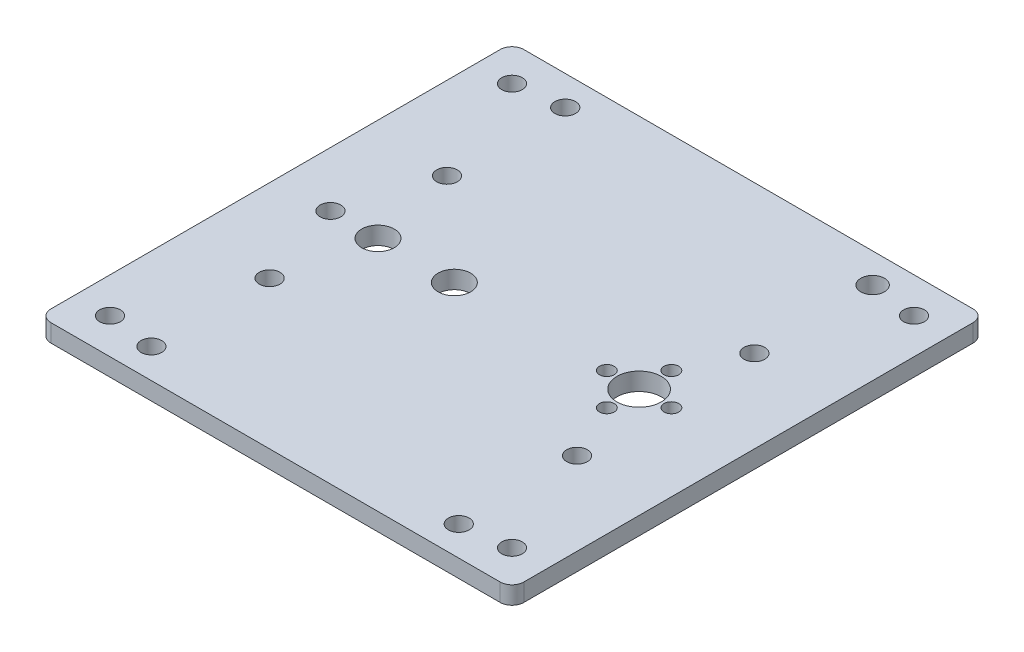
ISO-10303-21;
HEADER;
FILE_DESCRIPTION(('STEP AP214'),'2;1');
FILE_NAME('part.step','',(''),(''),'','','');
FILE_SCHEMA(('AUTOMOTIVE_DESIGN { 1 0 10303 214 1 1 1 1 }'));
ENDSEC;
DATA;
#1=APPLICATION_CONTEXT('core data for automotive mechanical design processes');
#2=APPLICATION_PROTOCOL_DEFINITION('international standard','automotive_design',2000,#1);
#3=PRODUCT_CONTEXT('',#1,'mechanical');
#4=PRODUCT('Part','Part','',(#3));
#5=PRODUCT_RELATED_PRODUCT_CATEGORY('part','',(#4));
#6=PRODUCT_DEFINITION_FORMATION('','',#4);
#7=PRODUCT_DEFINITION_CONTEXT('part definition',#1,'design');
#8=PRODUCT_DEFINITION('design','',#6,#7);
#9=PRODUCT_DEFINITION_SHAPE('','',#8);
#10=(LENGTH_UNIT() NAMED_UNIT(*) SI_UNIT(.MILLI.,.METRE.));
#11=(NAMED_UNIT(*) PLANE_ANGLE_UNIT() SI_UNIT($,.RADIAN.));
#12=(NAMED_UNIT(*) SI_UNIT($,.STERADIAN.) SOLID_ANGLE_UNIT());
#13=UNCERTAINTY_MEASURE_WITH_UNIT(LENGTH_MEASURE(1.E-05),#10,'distance_accuracy_value','');
#14=(GEOMETRIC_REPRESENTATION_CONTEXT(3) GLOBAL_UNCERTAINTY_ASSIGNED_CONTEXT((#13)) GLOBAL_UNIT_ASSIGNED_CONTEXT((#10,
#11,#12)) REPRESENTATION_CONTEXT('',''));
#15=CARTESIAN_POINT('',(0.,0.,0.));
#16=DIRECTION('',(0.,0.,1.));
#17=DIRECTION('',(1.,0.,0.));
#18=AXIS2_PLACEMENT_3D('',#15,#16,#17);
#19=CARTESIAN_POINT('',(0.,3.,0.));
#20=DIRECTION('',(1.,0.,0.));
#21=DIRECTION('',(0.,0.,-1.));
#22=AXIS2_PLACEMENT_3D('',#19,#20,#21);
#23=PLANE('',#22);
#24=DIRECTION('',(0.,0.,1.));
#25=VECTOR('',#24,1.);
#26=CARTESIAN_POINT('',(0.,3.,0.));
#27=LINE('',#26,#25);
#28=CARTESIAN_POINT('',(0.,3.,-78.));
#29=VERTEX_POINT('',#28);
#30=CARTESIAN_POINT('',(0.,3.,-2.));
#31=VERTEX_POINT('',#30);
#32=EDGE_CURVE('E119',#29,#31,#27,.T.);
#33=ORIENTED_EDGE('',*,*,#32,.F.);
#34=DIRECTION('',(0.,-1.,0.));
#35=VECTOR('',#34,1.);
#36=CARTESIAN_POINT('',(0.,3.,-78.));
#37=LINE('',#36,#35);
#38=CARTESIAN_POINT('',(0.,0.,-78.));
#39=VERTEX_POINT('',#38);
#40=EDGE_CURVE('E104',#29,#39,#37,.T.);
#41=ORIENTED_EDGE('',*,*,#40,.T.);
#42=DIRECTION('',(0.,0.,1.));
#43=VECTOR('',#42,1.);
#44=CARTESIAN_POINT('',(0.,0.,0.));
#45=LINE('',#44,#43);
#46=CARTESIAN_POINT('',(0.,0.,-2.));
#47=VERTEX_POINT('',#46);
#48=EDGE_CURVE('E116',#39,#47,#45,.T.);
#49=ORIENTED_EDGE('',*,*,#48,.T.);
#50=DIRECTION('',(0.,-1.,0.));
#51=VECTOR('',#50,1.);
#52=CARTESIAN_POINT('',(0.,3.,-2.));
#53=LINE('',#52,#51);
#54=EDGE_CURVE('E121',#47,#31,#53,.F.);
#55=ORIENTED_EDGE('',*,*,#54,.T.);
#56=EDGE_LOOP('',(#33,#41,#49,#55));
#57=FACE_BOUND('',#56,.T.);
#58=ADVANCED_FACE('F33',(#57),#23,.F.);
#59=CARTESIAN_POINT('',(0.,3.,0.));
#60=DIRECTION('',(0.,0.,-1.));
#61=DIRECTION('',(-1.,0.,0.));
#62=AXIS2_PLACEMENT_3D('',#59,#60,#61);
#63=PLANE('',#62);
#64=DIRECTION('',(1.,0.,0.));
#65=VECTOR('',#64,1.);
#66=CARTESIAN_POINT('',(0.,3.,0.));
#67=LINE('',#66,#65);
#68=CARTESIAN_POINT('',(2.,3.,0.));
#69=VERTEX_POINT('',#68);
#70=CARTESIAN_POINT('',(78.,3.,0.));
#71=VERTEX_POINT('',#70);
#72=EDGE_CURVE('E163',#69,#71,#67,.T.);
#73=ORIENTED_EDGE('',*,*,#72,.F.);
#74=DIRECTION('',(0.,-1.,0.));
#75=VECTOR('',#74,1.);
#76=CARTESIAN_POINT('',(2.,3.,0.));
#77=LINE('',#76,#75);
#78=CARTESIAN_POINT('',(2.,0.,0.));
#79=VERTEX_POINT('',#78);
#80=EDGE_CURVE('E11',#69,#79,#77,.T.);
#81=ORIENTED_EDGE('',*,*,#80,.T.);
#82=DIRECTION('',(1.,0.,0.));
#83=VECTOR('',#82,1.);
#84=CARTESIAN_POINT('',(0.,0.,0.));
#85=LINE('',#84,#83);
#86=CARTESIAN_POINT('',(78.,0.,0.));
#87=VERTEX_POINT('',#86);
#88=EDGE_CURVE('E126',#79,#87,#85,.T.);
#89=ORIENTED_EDGE('',*,*,#88,.T.);
#90=DIRECTION('',(0.,-1.,0.));
#91=VECTOR('',#90,1.);
#92=CARTESIAN_POINT('',(78.,3.,0.));
#93=LINE('',#92,#91);
#94=EDGE_CURVE('E41',#87,#71,#93,.F.);
#95=ORIENTED_EDGE('',*,*,#94,.T.);
#96=EDGE_LOOP('',(#73,#81,#89,#95));
#97=FACE_BOUND('',#96,.T.);
#98=ADVANCED_FACE('F162',(#97),#63,.F.);
#99=CARTESIAN_POINT('',(80.,3.,0.));
#100=DIRECTION('',(-1.,0.,0.));
#101=DIRECTION('',(0.,0.,1.));
#102=AXIS2_PLACEMENT_3D('',#99,#100,#101);
#103=PLANE('',#102);
#104=DIRECTION('',(0.,0.,-1.));
#105=VECTOR('',#104,1.);
#106=CARTESIAN_POINT('',(80.,0.,0.));
#107=LINE('',#106,#105);
#108=CARTESIAN_POINT('',(80.,0.,-2.));
#109=VERTEX_POINT('',#108);
#110=CARTESIAN_POINT('',(80.,0.,-78.));
#111=VERTEX_POINT('',#110);
#112=EDGE_CURVE('E130',#109,#111,#107,.T.);
#113=ORIENTED_EDGE('',*,*,#112,.T.);
#114=DIRECTION('',(0.,-1.,0.));
#115=VECTOR('',#114,1.);
#116=CARTESIAN_POINT('',(80.,3.,-78.));
#117=LINE('',#116,#115);
#118=CARTESIAN_POINT('',(80.,3.,-78.));
#119=VERTEX_POINT('',#118);
#120=EDGE_CURVE('E48',#111,#119,#117,.F.);
#121=ORIENTED_EDGE('',*,*,#120,.T.);
#122=DIRECTION('',(0.,0.,-1.));
#123=VECTOR('',#122,1.);
#124=CARTESIAN_POINT('',(80.,3.,0.));
#125=LINE('',#124,#123);
#126=CARTESIAN_POINT('',(80.,3.,-2.));
#127=VERTEX_POINT('',#126);
#128=EDGE_CURVE('E169',#127,#119,#125,.T.);
#129=ORIENTED_EDGE('',*,*,#128,.F.);
#130=DIRECTION('',(0.,-1.,0.));
#131=VECTOR('',#130,1.);
#132=CARTESIAN_POINT('',(80.,3.,-2.));
#133=LINE('',#132,#131);
#134=EDGE_CURVE('E156',#127,#109,#133,.T.);
#135=ORIENTED_EDGE('',*,*,#134,.T.);
#136=EDGE_LOOP('',(#113,#121,#129,#135));
#137=FACE_BOUND('',#136,.T.);
#138=ADVANCED_FACE('F173',(#137),#103,.F.);
#139=CARTESIAN_POINT('',(0.,3.,-80.));
#140=DIRECTION('',(0.,0.,1.));
#141=DIRECTION('',(1.,0.,0.));
#142=AXIS2_PLACEMENT_3D('',#139,#140,#141);
#143=PLANE('',#142);
#144=DIRECTION('',(-1.,0.,0.));
#145=VECTOR('',#144,1.);
#146=CARTESIAN_POINT('',(0.,0.,-80.));
#147=LINE('',#146,#145);
#148=CARTESIAN_POINT('',(78.,0.,-80.));
#149=VERTEX_POINT('',#148);
#150=CARTESIAN_POINT('',(2.,0.,-80.));
#151=VERTEX_POINT('',#150);
#152=EDGE_CURVE('E140',#149,#151,#147,.T.);
#153=ORIENTED_EDGE('',*,*,#152,.T.);
#154=DIRECTION('',(0.,-1.,0.));
#155=VECTOR('',#154,1.);
#156=CARTESIAN_POINT('',(2.,3.,-80.));
#157=LINE('',#156,#155);
#158=CARTESIAN_POINT('',(2.,3.,-80.));
#159=VERTEX_POINT('',#158);
#160=EDGE_CURVE('E105',#151,#159,#157,.F.);
#161=ORIENTED_EDGE('',*,*,#160,.T.);
#162=DIRECTION('',(-1.,0.,0.));
#163=VECTOR('',#162,1.);
#164=CARTESIAN_POINT('',(0.,3.,-80.));
#165=LINE('',#164,#163);
#166=CARTESIAN_POINT('',(78.,3.,-80.));
#167=VERTEX_POINT('',#166);
#168=EDGE_CURVE('E136',#167,#159,#165,.T.);
#169=ORIENTED_EDGE('',*,*,#168,.F.);
#170=DIRECTION('',(0.,-1.,0.));
#171=VECTOR('',#170,1.);
#172=CARTESIAN_POINT('',(78.,3.,-80.));
#173=LINE('',#172,#171);
#174=EDGE_CURVE('E110',#167,#149,#173,.T.);
#175=ORIENTED_EDGE('',*,*,#174,.T.);
#176=EDGE_LOOP('',(#153,#161,#169,#175));
#177=FACE_BOUND('',#176,.T.);
#178=ADVANCED_FACE('F180',(#177),#143,.F.);
#179=CARTESIAN_POINT('',(0.,3.,0.));
#180=DIRECTION('',(0.,-1.,0.));
#181=DIRECTION('',(0.,0.,-1.));
#182=AXIS2_PLACEMENT_3D('',#179,#180,#181);
#183=PLANE('',#182);
#184=CARTESIAN_POINT('',(66.,3.,-55.));
#185=DIRECTION('',(0.,1.,0.));
#186=DIRECTION('',(0.,0.,1.));
#187=AXIS2_PLACEMENT_3D('',#184,#185,#186);
#188=CIRCLE('',#187,1.75);
#189=CARTESIAN_POINT('',(66.,3.,-53.25));
#190=VERTEX_POINT('',#189);
#191=EDGE_CURVE('E294',#190,#190,#188,.T.);
#192=ORIENTED_EDGE('',*,*,#191,.F.);
#193=EDGE_LOOP('',(#192));
#194=FACE_BOUND('',#193,.T.);
#195=CARTESIAN_POINT('',(66.,3.,-75.));
#196=DIRECTION('',(0.,1.,0.));
#197=DIRECTION('',(0.,0.,1.));
#198=AXIS2_PLACEMENT_3D('',#195,#196,#197);
#199=CIRCLE('',#198,2.);
#200=CARTESIAN_POINT('',(66.,3.,-73.));
#201=VERTEX_POINT('',#200);
#202=EDGE_CURVE('E288',#201,#201,#199,.T.);
#203=ORIENTED_EDGE('',*,*,#202,.F.);
#204=EDGE_LOOP('',(#203));
#205=FACE_BOUND('',#204,.T.);
#206=CARTESIAN_POINT('',(14.,3.,-55.));
#207=DIRECTION('',(0.,1.,0.));
#208=DIRECTION('',(0.,0.,1.));
#209=AXIS2_PLACEMENT_3D('',#206,#207,#208);
#210=CIRCLE('',#209,1.75);
#211=CARTESIAN_POINT('',(14.,3.,-53.25));
#212=VERTEX_POINT('',#211);
#213=EDGE_CURVE('E282',#212,#212,#210,.T.);
#214=ORIENTED_EDGE('',*,*,#213,.F.);
#215=EDGE_LOOP('',(#214));
#216=FACE_BOUND('',#215,.T.);
#217=CARTESIAN_POINT('',(14.,3.,-75.));
#218=DIRECTION('',(0.,1.,0.));
#219=DIRECTION('',(0.,0.,1.));
#220=AXIS2_PLACEMENT_3D('',#217,#218,#219);
#221=CIRCLE('',#220,1.75);
#222=CARTESIAN_POINT('',(14.,3.,-73.25));
#223=VERTEX_POINT('',#222);
#224=EDGE_CURVE('E276',#223,#223,#221,.T.);
#225=ORIENTED_EDGE('',*,*,#224,.F.);
#226=EDGE_LOOP('',(#225));
#227=FACE_BOUND('',#226,.T.);
#228=CARTESIAN_POINT('',(14.,3.,-5.));
#229=DIRECTION('',(0.,1.,0.));
#230=DIRECTION('',(0.,0.,1.));
#231=AXIS2_PLACEMENT_3D('',#228,#229,#230);
#232=CIRCLE('',#231,1.75);
#233=CARTESIAN_POINT('',(14.,3.,-3.25000000000001));
#234=VERTEX_POINT('',#233);
#235=EDGE_CURVE('E270',#234,#234,#232,.T.);
#236=ORIENTED_EDGE('',*,*,#235,.F.);
#237=EDGE_LOOP('',(#236));
#238=FACE_BOUND('',#237,.T.);
#239=CARTESIAN_POINT('',(14.,3.,-25.));
#240=DIRECTION('',(0.,1.,0.));
#241=DIRECTION('',(0.,0.,1.));
#242=AXIS2_PLACEMENT_3D('',#239,#240,#241);
#243=CIRCLE('',#242,1.75);
#244=CARTESIAN_POINT('',(14.,3.,-23.25));
#245=VERTEX_POINT('',#244);
#246=EDGE_CURVE('E264',#245,#245,#243,.T.);
#247=ORIENTED_EDGE('',*,*,#246,.F.);
#248=EDGE_LOOP('',(#247));
#249=FACE_BOUND('',#248,.T.);
#250=CARTESIAN_POINT('',(66.,3.,-25.));
#251=DIRECTION('',(0.,1.,0.));
#252=DIRECTION('',(0.,0.,1.));
#253=AXIS2_PLACEMENT_3D('',#250,#251,#252);
#254=CIRCLE('',#253,1.75);
#255=CARTESIAN_POINT('',(66.,3.,-23.25));
#256=VERTEX_POINT('',#255);
#257=EDGE_CURVE('E258',#256,#256,#254,.T.);
#258=ORIENTED_EDGE('',*,*,#257,.F.);
#259=EDGE_LOOP('',(#258));
#260=FACE_BOUND('',#259,.T.);
#261=CARTESIAN_POINT('',(66.,3.,-5.));
#262=DIRECTION('',(0.,1.,0.));
#263=DIRECTION('',(0.,0.,1.));
#264=AXIS2_PLACEMENT_3D('',#261,#262,#263);
#265=CIRCLE('',#264,1.75);
#266=CARTESIAN_POINT('',(66.,3.,-3.25000000000001));
#267=VERTEX_POINT('',#266);
#268=EDGE_CURVE('E252',#267,#267,#265,.T.);
#269=ORIENTED_EDGE('',*,*,#268,.F.);
#270=EDGE_LOOP('',(#269));
#271=FACE_BOUND('',#270,.T.);
#272=CARTESIAN_POINT('',(6.00000000000001,3.,-6.00000000000002));
#273=DIRECTION('',(0.,1.,0.));
#274=DIRECTION('',(0.,0.,-1.));
#275=AXIS2_PLACEMENT_3D('',#272,#273,#274);
#276=CIRCLE('',#275,1.75);
#277=CARTESIAN_POINT('',(6.00000000000001,3.,-7.75000000000002));
#278=VERTEX_POINT('',#277);
#279=EDGE_CURVE('E246',#278,#278,#276,.T.);
#280=ORIENTED_EDGE('',*,*,#279,.F.);
#281=EDGE_LOOP('',(#280));
#282=FACE_BOUND('',#281,.T.);
#283=CARTESIAN_POINT('',(74.,3.,-6.00000000000002));
#284=DIRECTION('',(0.,1.,0.));
#285=DIRECTION('',(0.,0.,1.));
#286=AXIS2_PLACEMENT_3D('',#283,#284,#285);
#287=CIRCLE('',#286,1.75);
#288=CARTESIAN_POINT('',(74.,3.,-4.25000000000002));
#289=VERTEX_POINT('',#288);
#290=EDGE_CURVE('E240',#289,#289,#287,.T.);
#291=ORIENTED_EDGE('',*,*,#290,.F.);
#292=EDGE_LOOP('',(#291));
#293=FACE_BOUND('',#292,.T.);
#294=CARTESIAN_POINT('',(74.,3.,-74.));
#295=DIRECTION('',(0.,1.,0.));
#296=DIRECTION('',(0.,0.,-1.));
#297=AXIS2_PLACEMENT_3D('',#294,#295,#296);
#298=CIRCLE('',#297,1.75);
#299=CARTESIAN_POINT('',(74.,3.,-75.75));
#300=VERTEX_POINT('',#299);
#301=EDGE_CURVE('E234',#300,#300,#298,.T.);
#302=ORIENTED_EDGE('',*,*,#301,.F.);
#303=EDGE_LOOP('',(#302));
#304=FACE_BOUND('',#303,.T.);
#305=CARTESIAN_POINT('',(6.00000000000001,3.,-74.));
#306=DIRECTION('',(0.,1.,0.));
#307=DIRECTION('',(0.,0.,1.));
#308=AXIS2_PLACEMENT_3D('',#305,#306,#307);
#309=CIRCLE('',#308,1.75);
#310=CARTESIAN_POINT('',(6.00000000000001,3.,-72.25));
#311=VERTEX_POINT('',#310);
#312=EDGE_CURVE('E228',#311,#311,#309,.T.);
#313=ORIENTED_EDGE('',*,*,#312,.F.);
#314=EDGE_LOOP('',(#313));
#315=FACE_BOUND('',#314,.T.);
#316=CARTESIAN_POINT('',(30.25,3.,-40.));
#317=DIRECTION('',(0.,1.,0.));
#318=DIRECTION('',(0.,0.,1.));
#319=AXIS2_PLACEMENT_3D('',#316,#317,#318);
#320=CIRCLE('',#319,2.75);
#321=CARTESIAN_POINT('',(30.25,3.,-37.25));
#322=VERTEX_POINT('',#321);
#323=EDGE_CURVE('E222',#322,#322,#320,.T.);
#324=ORIENTED_EDGE('',*,*,#323,.F.);
#325=EDGE_LOOP('',(#324));
#326=FACE_BOUND('',#325,.T.);
#327=CARTESIAN_POINT('',(61.5,3.,-45.46));
#328=DIRECTION('',(0.,1.,0.));
#329=DIRECTION('',(0.,0.,1.));
#330=AXIS2_PLACEMENT_3D('',#327,#328,#329);
#331=CIRCLE('',#330,1.25);
#332=CARTESIAN_POINT('',(61.5,3.,-44.21));
#333=VERTEX_POINT('',#332);
#334=EDGE_CURVE('E216',#333,#333,#331,.T.);
#335=ORIENTED_EDGE('',*,*,#334,.F.);
#336=EDGE_LOOP('',(#335));
#337=FACE_BOUND('',#336,.T.);
#338=CARTESIAN_POINT('',(61.5,3.,-34.54));
#339=DIRECTION('',(0.,1.,0.));
#340=DIRECTION('',(0.,0.,1.));
#341=AXIS2_PLACEMENT_3D('',#338,#339,#340);
#342=CIRCLE('',#341,1.25);
#343=CARTESIAN_POINT('',(61.5,3.,-33.29));
#344=VERTEX_POINT('',#343);
#345=EDGE_CURVE('E210',#344,#344,#342,.T.);
#346=ORIENTED_EDGE('',*,*,#345,.F.);
#347=EDGE_LOOP('',(#346));
#348=FACE_BOUND('',#347,.T.);
#349=CARTESIAN_POINT('',(56.04,3.,-40.));
#350=DIRECTION('',(0.,1.,0.));
#351=DIRECTION('',(0.,0.,1.));
#352=AXIS2_PLACEMENT_3D('',#349,#350,#351);
#353=CIRCLE('',#352,1.25);
#354=CARTESIAN_POINT('',(56.04,3.,-38.75));
#355=VERTEX_POINT('',#354);
#356=EDGE_CURVE('E204',#355,#355,#353,.T.);
#357=ORIENTED_EDGE('',*,*,#356,.F.);
#358=EDGE_LOOP('',(#357));
#359=FACE_BOUND('',#358,.T.);
#360=CARTESIAN_POINT('',(66.96,3.,-40.));
#361=DIRECTION('',(0.,1.,0.));
#362=DIRECTION('',(0.,0.,1.));
#363=AXIS2_PLACEMENT_3D('',#360,#361,#362);
#364=CIRCLE('',#363,1.25);
#365=CARTESIAN_POINT('',(66.96,3.,-38.75));
#366=VERTEX_POINT('',#365);
#367=EDGE_CURVE('E198',#366,#366,#364,.T.);
#368=ORIENTED_EDGE('',*,*,#367,.F.);
#369=EDGE_LOOP('',(#368));
#370=FACE_BOUND('',#369,.T.);
#371=CARTESIAN_POINT('',(61.5,3.,-40.));
#372=DIRECTION('',(0.,1.,0.));
#373=DIRECTION('',(0.,0.,1.));
#374=AXIS2_PLACEMENT_3D('',#371,#372,#373);
#375=CIRCLE('',#374,3.75000000000001);
#376=CARTESIAN_POINT('',(61.5,3.,-36.25));
#377=VERTEX_POINT('',#376);
#378=EDGE_CURVE('E192',#377,#377,#375,.T.);
#379=ORIENTED_EDGE('',*,*,#378,.F.);
#380=EDGE_LOOP('',(#379));
#381=FACE_BOUND('',#380,.T.);
#382=CARTESIAN_POINT('',(17.33,3.,-40.));
#383=DIRECTION('',(0.,1.,0.));
#384=DIRECTION('',(0.,0.,1.));
#385=AXIS2_PLACEMENT_3D('',#382,#383,#384);
#386=CIRCLE('',#385,2.75);
#387=CARTESIAN_POINT('',(17.33,3.,-37.25));
#388=VERTEX_POINT('',#387);
#389=EDGE_CURVE('E186',#388,#388,#386,.T.);
#390=ORIENTED_EDGE('',*,*,#389,.F.);
#391=EDGE_LOOP('',(#390));
#392=FACE_BOUND('',#391,.T.);
#393=CARTESIAN_POINT('',(9.29,3.,-40.));
#394=DIRECTION('',(0.,1.,0.));
#395=DIRECTION('',(0.,0.,1.));
#396=AXIS2_PLACEMENT_3D('',#393,#394,#395);
#397=CIRCLE('',#396,1.75);
#398=CARTESIAN_POINT('',(9.29,3.,-38.25));
#399=VERTEX_POINT('',#398);
#400=EDGE_CURVE('E133',#399,#399,#397,.T.);
#401=ORIENTED_EDGE('',*,*,#400,.F.);
#402=EDGE_LOOP('',(#401));
#403=FACE_BOUND('',#402,.T.);
#404=ORIENTED_EDGE('',*,*,#168,.T.);
#405=CARTESIAN_POINT('',(2.,3.,-78.));
#406=DIRECTION('',(0.,-1.,0.));
#407=DIRECTION('',(0.,0.,-1.));
#408=AXIS2_PLACEMENT_3D('',#405,#406,#407);
#409=CIRCLE('',#408,2.);
#410=EDGE_CURVE('E154',#159,#29,#409,.F.);
#411=ORIENTED_EDGE('',*,*,#410,.T.);
#412=ORIENTED_EDGE('',*,*,#32,.T.);
#413=CARTESIAN_POINT('',(2.,3.,-2.));
#414=DIRECTION('',(0.,-1.,0.));
#415=DIRECTION('',(0.,0.,-1.));
#416=AXIS2_PLACEMENT_3D('',#413,#414,#415);
#417=CIRCLE('',#416,2.);
#418=EDGE_CURVE('E150',#31,#69,#417,.F.);
#419=ORIENTED_EDGE('',*,*,#418,.T.);
#420=ORIENTED_EDGE('',*,*,#72,.T.);
#421=CARTESIAN_POINT('',(78.,3.,-2.));
#422=DIRECTION('',(0.,-1.,0.));
#423=DIRECTION('',(0.,0.,-1.));
#424=AXIS2_PLACEMENT_3D('',#421,#422,#423);
#425=CIRCLE('',#424,2.);
#426=EDGE_CURVE('E55',#71,#127,#425,.F.);
#427=ORIENTED_EDGE('',*,*,#426,.T.);
#428=ORIENTED_EDGE('',*,*,#128,.T.);
#429=CARTESIAN_POINT('',(78.,3.,-78.));
#430=DIRECTION('',(0.,-1.,0.));
#431=DIRECTION('',(0.,0.,-1.));
#432=AXIS2_PLACEMENT_3D('',#429,#430,#431);
#433=CIRCLE('',#432,2.);
#434=EDGE_CURVE('E152',#119,#167,#433,.F.);
#435=ORIENTED_EDGE('',*,*,#434,.T.);
#436=EDGE_LOOP('',(#404,#411,#412,#419,#420,#427,#428,#435));
#437=FACE_BOUND('',#436,.T.);
#438=ADVANCED_FACE('F167',(#194,#205,#216,#227,#238,#249,#260,#271,#282,#293,#304,#315,#326,
#337,#348,#359,#370,#381,#392,#403,#437),#183,.F.);
#439=CARTESIAN_POINT('',(0.,0.,0.));
#440=DIRECTION('',(0.,-1.,0.));
#441=DIRECTION('',(0.,0.,-1.));
#442=AXIS2_PLACEMENT_3D('',#439,#440,#441);
#443=PLANE('',#442);
#444=CARTESIAN_POINT('',(66.,0.,-55.));
#445=DIRECTION('',(0.,1.,0.));
#446=DIRECTION('',(0.,0.,1.));
#447=AXIS2_PLACEMENT_3D('',#444,#445,#446);
#448=CIRCLE('',#447,1.75);
#449=CARTESIAN_POINT('',(66.,0.,-53.25));
#450=VERTEX_POINT('',#449);
#451=EDGE_CURVE('E291',#450,#450,#448,.T.);
#452=ORIENTED_EDGE('',*,*,#451,.T.);
#453=EDGE_LOOP('',(#452));
#454=FACE_BOUND('',#453,.T.);
#455=CARTESIAN_POINT('',(66.,0.,-75.));
#456=DIRECTION('',(0.,1.,0.));
#457=DIRECTION('',(0.,0.,1.));
#458=AXIS2_PLACEMENT_3D('',#455,#456,#457);
#459=CIRCLE('',#458,2.);
#460=CARTESIAN_POINT('',(66.,0.,-73.));
#461=VERTEX_POINT('',#460);
#462=EDGE_CURVE('E285',#461,#461,#459,.T.);
#463=ORIENTED_EDGE('',*,*,#462,.T.);
#464=EDGE_LOOP('',(#463));
#465=FACE_BOUND('',#464,.T.);
#466=CARTESIAN_POINT('',(14.,0.,-55.));
#467=DIRECTION('',(0.,1.,0.));
#468=DIRECTION('',(0.,0.,1.));
#469=AXIS2_PLACEMENT_3D('',#466,#467,#468);
#470=CIRCLE('',#469,1.75);
#471=CARTESIAN_POINT('',(14.,0.,-53.25));
#472=VERTEX_POINT('',#471);
#473=EDGE_CURVE('E279',#472,#472,#470,.T.);
#474=ORIENTED_EDGE('',*,*,#473,.T.);
#475=EDGE_LOOP('',(#474));
#476=FACE_BOUND('',#475,.T.);
#477=CARTESIAN_POINT('',(14.,0.,-75.));
#478=DIRECTION('',(0.,1.,0.));
#479=DIRECTION('',(0.,0.,1.));
#480=AXIS2_PLACEMENT_3D('',#477,#478,#479);
#481=CIRCLE('',#480,1.75);
#482=CARTESIAN_POINT('',(14.,0.,-73.25));
#483=VERTEX_POINT('',#482);
#484=EDGE_CURVE('E273',#483,#483,#481,.T.);
#485=ORIENTED_EDGE('',*,*,#484,.T.);
#486=EDGE_LOOP('',(#485));
#487=FACE_BOUND('',#486,.T.);
#488=CARTESIAN_POINT('',(14.,0.,-5.));
#489=DIRECTION('',(0.,1.,0.));
#490=DIRECTION('',(0.,0.,1.));
#491=AXIS2_PLACEMENT_3D('',#488,#489,#490);
#492=CIRCLE('',#491,1.75);
#493=CARTESIAN_POINT('',(14.,0.,-3.25000000000001));
#494=VERTEX_POINT('',#493);
#495=EDGE_CURVE('E267',#494,#494,#492,.T.);
#496=ORIENTED_EDGE('',*,*,#495,.T.);
#497=EDGE_LOOP('',(#496));
#498=FACE_BOUND('',#497,.T.);
#499=CARTESIAN_POINT('',(14.,0.,-25.));
#500=DIRECTION('',(0.,1.,0.));
#501=DIRECTION('',(0.,0.,1.));
#502=AXIS2_PLACEMENT_3D('',#499,#500,#501);
#503=CIRCLE('',#502,1.75);
#504=CARTESIAN_POINT('',(14.,0.,-23.25));
#505=VERTEX_POINT('',#504);
#506=EDGE_CURVE('E261',#505,#505,#503,.T.);
#507=ORIENTED_EDGE('',*,*,#506,.T.);
#508=EDGE_LOOP('',(#507));
#509=FACE_BOUND('',#508,.T.);
#510=CARTESIAN_POINT('',(66.,0.,-25.));
#511=DIRECTION('',(0.,1.,0.));
#512=DIRECTION('',(0.,0.,1.));
#513=AXIS2_PLACEMENT_3D('',#510,#511,#512);
#514=CIRCLE('',#513,1.75);
#515=CARTESIAN_POINT('',(66.,0.,-23.25));
#516=VERTEX_POINT('',#515);
#517=EDGE_CURVE('E255',#516,#516,#514,.T.);
#518=ORIENTED_EDGE('',*,*,#517,.T.);
#519=EDGE_LOOP('',(#518));
#520=FACE_BOUND('',#519,.T.);
#521=CARTESIAN_POINT('',(66.,0.,-5.));
#522=DIRECTION('',(0.,1.,0.));
#523=DIRECTION('',(0.,0.,1.));
#524=AXIS2_PLACEMENT_3D('',#521,#522,#523);
#525=CIRCLE('',#524,1.75);
#526=CARTESIAN_POINT('',(66.,0.,-3.25000000000001));
#527=VERTEX_POINT('',#526);
#528=EDGE_CURVE('E249',#527,#527,#525,.T.);
#529=ORIENTED_EDGE('',*,*,#528,.T.);
#530=EDGE_LOOP('',(#529));
#531=FACE_BOUND('',#530,.T.);
#532=CARTESIAN_POINT('',(6.00000000000001,0.,-6.00000000000002));
#533=DIRECTION('',(0.,1.,0.));
#534=DIRECTION('',(0.,0.,-1.));
#535=AXIS2_PLACEMENT_3D('',#532,#533,#534);
#536=CIRCLE('',#535,1.75);
#537=CARTESIAN_POINT('',(6.00000000000001,0.,-7.75000000000002));
#538=VERTEX_POINT('',#537);
#539=EDGE_CURVE('E243',#538,#538,#536,.T.);
#540=ORIENTED_EDGE('',*,*,#539,.T.);
#541=EDGE_LOOP('',(#540));
#542=FACE_BOUND('',#541,.T.);
#543=CARTESIAN_POINT('',(74.,0.,-6.00000000000002));
#544=DIRECTION('',(0.,1.,0.));
#545=DIRECTION('',(0.,0.,1.));
#546=AXIS2_PLACEMENT_3D('',#543,#544,#545);
#547=CIRCLE('',#546,1.75);
#548=CARTESIAN_POINT('',(74.,0.,-4.25000000000002));
#549=VERTEX_POINT('',#548);
#550=EDGE_CURVE('E237',#549,#549,#547,.T.);
#551=ORIENTED_EDGE('',*,*,#550,.T.);
#552=EDGE_LOOP('',(#551));
#553=FACE_BOUND('',#552,.T.);
#554=CARTESIAN_POINT('',(74.,0.,-74.));
#555=DIRECTION('',(0.,1.,0.));
#556=DIRECTION('',(0.,0.,-1.));
#557=AXIS2_PLACEMENT_3D('',#554,#555,#556);
#558=CIRCLE('',#557,1.75);
#559=CARTESIAN_POINT('',(74.,0.,-75.75));
#560=VERTEX_POINT('',#559);
#561=EDGE_CURVE('E231',#560,#560,#558,.T.);
#562=ORIENTED_EDGE('',*,*,#561,.T.);
#563=EDGE_LOOP('',(#562));
#564=FACE_BOUND('',#563,.T.);
#565=CARTESIAN_POINT('',(6.00000000000001,0.,-74.));
#566=DIRECTION('',(0.,1.,0.));
#567=DIRECTION('',(0.,0.,1.));
#568=AXIS2_PLACEMENT_3D('',#565,#566,#567);
#569=CIRCLE('',#568,1.75);
#570=CARTESIAN_POINT('',(6.00000000000001,0.,-72.25));
#571=VERTEX_POINT('',#570);
#572=EDGE_CURVE('E225',#571,#571,#569,.T.);
#573=ORIENTED_EDGE('',*,*,#572,.T.);
#574=EDGE_LOOP('',(#573));
#575=FACE_BOUND('',#574,.T.);
#576=CARTESIAN_POINT('',(30.25,0.,-40.));
#577=DIRECTION('',(0.,1.,0.));
#578=DIRECTION('',(0.,0.,1.));
#579=AXIS2_PLACEMENT_3D('',#576,#577,#578);
#580=CIRCLE('',#579,2.75);
#581=CARTESIAN_POINT('',(30.25,0.,-37.25));
#582=VERTEX_POINT('',#581);
#583=EDGE_CURVE('E219',#582,#582,#580,.T.);
#584=ORIENTED_EDGE('',*,*,#583,.T.);
#585=EDGE_LOOP('',(#584));
#586=FACE_BOUND('',#585,.T.);
#587=CARTESIAN_POINT('',(61.5,0.,-45.46));
#588=DIRECTION('',(0.,1.,0.));
#589=DIRECTION('',(0.,0.,1.));
#590=AXIS2_PLACEMENT_3D('',#587,#588,#589);
#591=CIRCLE('',#590,1.25);
#592=CARTESIAN_POINT('',(61.5,0.,-44.21));
#593=VERTEX_POINT('',#592);
#594=EDGE_CURVE('E213',#593,#593,#591,.T.);
#595=ORIENTED_EDGE('',*,*,#594,.T.);
#596=EDGE_LOOP('',(#595));
#597=FACE_BOUND('',#596,.T.);
#598=CARTESIAN_POINT('',(61.5,0.,-34.54));
#599=DIRECTION('',(0.,1.,0.));
#600=DIRECTION('',(0.,0.,1.));
#601=AXIS2_PLACEMENT_3D('',#598,#599,#600);
#602=CIRCLE('',#601,1.25);
#603=CARTESIAN_POINT('',(61.5,0.,-33.29));
#604=VERTEX_POINT('',#603);
#605=EDGE_CURVE('E207',#604,#604,#602,.T.);
#606=ORIENTED_EDGE('',*,*,#605,.T.);
#607=EDGE_LOOP('',(#606));
#608=FACE_BOUND('',#607,.T.);
#609=CARTESIAN_POINT('',(56.04,0.,-40.));
#610=DIRECTION('',(0.,1.,0.));
#611=DIRECTION('',(0.,0.,1.));
#612=AXIS2_PLACEMENT_3D('',#609,#610,#611);
#613=CIRCLE('',#612,1.25);
#614=CARTESIAN_POINT('',(56.04,0.,-38.75));
#615=VERTEX_POINT('',#614);
#616=EDGE_CURVE('E201',#615,#615,#613,.T.);
#617=ORIENTED_EDGE('',*,*,#616,.T.);
#618=EDGE_LOOP('',(#617));
#619=FACE_BOUND('',#618,.T.);
#620=CARTESIAN_POINT('',(66.96,0.,-40.));
#621=DIRECTION('',(0.,1.,0.));
#622=DIRECTION('',(0.,0.,1.));
#623=AXIS2_PLACEMENT_3D('',#620,#621,#622);
#624=CIRCLE('',#623,1.25);
#625=CARTESIAN_POINT('',(66.96,0.,-38.75));
#626=VERTEX_POINT('',#625);
#627=EDGE_CURVE('E195',#626,#626,#624,.T.);
#628=ORIENTED_EDGE('',*,*,#627,.T.);
#629=EDGE_LOOP('',(#628));
#630=FACE_BOUND('',#629,.T.);
#631=CARTESIAN_POINT('',(61.5,0.,-40.));
#632=DIRECTION('',(0.,1.,0.));
#633=DIRECTION('',(0.,0.,1.));
#634=AXIS2_PLACEMENT_3D('',#631,#632,#633);
#635=CIRCLE('',#634,3.75000000000001);
#636=CARTESIAN_POINT('',(61.5,0.,-36.25));
#637=VERTEX_POINT('',#636);
#638=EDGE_CURVE('E189',#637,#637,#635,.T.);
#639=ORIENTED_EDGE('',*,*,#638,.T.);
#640=EDGE_LOOP('',(#639));
#641=FACE_BOUND('',#640,.T.);
#642=CARTESIAN_POINT('',(17.33,0.,-40.));
#643=DIRECTION('',(0.,1.,0.));
#644=DIRECTION('',(0.,0.,1.));
#645=AXIS2_PLACEMENT_3D('',#642,#643,#644);
#646=CIRCLE('',#645,2.75);
#647=CARTESIAN_POINT('',(17.33,0.,-37.25));
#648=VERTEX_POINT('',#647);
#649=EDGE_CURVE('E184',#648,#648,#646,.T.);
#650=ORIENTED_EDGE('',*,*,#649,.T.);
#651=EDGE_LOOP('',(#650));
#652=FACE_BOUND('',#651,.T.);
#653=CARTESIAN_POINT('',(9.29,0.,-40.));
#654=DIRECTION('',(0.,1.,0.));
#655=DIRECTION('',(0.,0.,1.));
#656=AXIS2_PLACEMENT_3D('',#653,#654,#655);
#657=CIRCLE('',#656,1.75);
#658=CARTESIAN_POINT('',(9.29,0.,-38.25));
#659=VERTEX_POINT('',#658);
#660=EDGE_CURVE('E127',#659,#659,#657,.T.);
#661=ORIENTED_EDGE('',*,*,#660,.T.);
#662=EDGE_LOOP('',(#661));
#663=FACE_BOUND('',#662,.T.);
#664=ORIENTED_EDGE('',*,*,#48,.F.);
#665=CARTESIAN_POINT('',(2.,0.,-78.));
#666=DIRECTION('',(0.,-1.,0.));
#667=DIRECTION('',(0.,0.,-1.));
#668=AXIS2_PLACEMENT_3D('',#665,#666,#667);
#669=CIRCLE('',#668,2.);
#670=EDGE_CURVE('E100',#39,#151,#669,.T.);
#671=ORIENTED_EDGE('',*,*,#670,.T.);
#672=ORIENTED_EDGE('',*,*,#152,.F.);
#673=CARTESIAN_POINT('',(78.,0.,-78.));
#674=DIRECTION('',(0.,-1.,0.));
#675=DIRECTION('',(0.,0.,-1.));
#676=AXIS2_PLACEMENT_3D('',#673,#674,#675);
#677=CIRCLE('',#676,2.);
#678=EDGE_CURVE('E111',#149,#111,#677,.T.);
#679=ORIENTED_EDGE('',*,*,#678,.T.);
#680=ORIENTED_EDGE('',*,*,#112,.F.);
#681=CARTESIAN_POINT('',(78.,0.,-2.));
#682=DIRECTION('',(0.,-1.,0.));
#683=DIRECTION('',(0.,0.,-1.));
#684=AXIS2_PLACEMENT_3D('',#681,#682,#683);
#685=CIRCLE('',#684,2.);
#686=EDGE_CURVE('E120',#109,#87,#685,.T.);
#687=ORIENTED_EDGE('',*,*,#686,.T.);
#688=ORIENTED_EDGE('',*,*,#88,.F.);
#689=CARTESIAN_POINT('',(2.,0.,-2.));
#690=DIRECTION('',(0.,-1.,0.));
#691=DIRECTION('',(0.,0.,-1.));
#692=AXIS2_PLACEMENT_3D('',#689,#690,#691);
#693=CIRCLE('',#692,2.);
#694=EDGE_CURVE('E125',#79,#47,#693,.T.);
#695=ORIENTED_EDGE('',*,*,#694,.T.);
#696=EDGE_LOOP('',(#664,#671,#672,#679,#680,#687,#688,#695));
#697=FACE_BOUND('',#696,.T.);
#698=ADVANCED_FACE('F123',(#454,#465,#476,#487,#498,#509,#520,#531,#542,#553,#564,#575,#586,
#597,#608,#619,#630,#641,#652,#663,#697),#443,.T.);
#699=CARTESIAN_POINT('',(9.29,0.,-40.));
#700=DIRECTION('',(0.,1.,0.));
#701=DIRECTION('',(0.,0.,1.));
#702=AXIS2_PLACEMENT_3D('',#699,#700,#701);
#703=CYLINDRICAL_SURFACE('',#702,1.75);
#704=ORIENTED_EDGE('',*,*,#660,.F.);
#705=EDGE_LOOP('',(#704));
#706=FACE_BOUND('',#705,.T.);
#707=ORIENTED_EDGE('',*,*,#400,.T.);
#708=EDGE_LOOP('',(#707));
#709=FACE_BOUND('',#708,.T.);
#710=ADVANCED_FACE('F350',(#706,#709),#703,.F.);
#711=CARTESIAN_POINT('',(17.33,0.,-40.));
#712=DIRECTION('',(0.,1.,0.));
#713=DIRECTION('',(0.,0.,1.));
#714=AXIS2_PLACEMENT_3D('',#711,#712,#713);
#715=CYLINDRICAL_SURFACE('',#714,2.75);
#716=ORIENTED_EDGE('',*,*,#649,.F.);
#717=EDGE_LOOP('',(#716));
#718=FACE_BOUND('',#717,.T.);
#719=ORIENTED_EDGE('',*,*,#389,.T.);
#720=EDGE_LOOP('',(#719));
#721=FACE_BOUND('',#720,.T.);
#722=ADVANCED_FACE('F352',(#718,#721),#715,.F.);
#723=CARTESIAN_POINT('',(61.5,0.,-40.));
#724=DIRECTION('',(0.,1.,0.));
#725=DIRECTION('',(0.,0.,1.));
#726=AXIS2_PLACEMENT_3D('',#723,#724,#725);
#727=CYLINDRICAL_SURFACE('',#726,3.75000000000001);
#728=ORIENTED_EDGE('',*,*,#638,.F.);
#729=EDGE_LOOP('',(#728));
#730=FACE_BOUND('',#729,.T.);
#731=ORIENTED_EDGE('',*,*,#378,.T.);
#732=EDGE_LOOP('',(#731));
#733=FACE_BOUND('',#732,.T.);
#734=ADVANCED_FACE('F359',(#730,#733),#727,.F.);
#735=CARTESIAN_POINT('',(66.96,0.,-40.));
#736=DIRECTION('',(0.,1.,0.));
#737=DIRECTION('',(0.,0.,1.));
#738=AXIS2_PLACEMENT_3D('',#735,#736,#737);
#739=CYLINDRICAL_SURFACE('',#738,1.25);
#740=ORIENTED_EDGE('',*,*,#627,.F.);
#741=EDGE_LOOP('',(#740));
#742=FACE_BOUND('',#741,.T.);
#743=ORIENTED_EDGE('',*,*,#367,.T.);
#744=EDGE_LOOP('',(#743));
#745=FACE_BOUND('',#744,.T.);
#746=ADVANCED_FACE('F431',(#742,#745),#739,.F.);
#747=CARTESIAN_POINT('',(56.04,0.,-40.));
#748=DIRECTION('',(0.,1.,0.));
#749=DIRECTION('',(0.,0.,1.));
#750=AXIS2_PLACEMENT_3D('',#747,#748,#749);
#751=CYLINDRICAL_SURFACE('',#750,1.25);
#752=ORIENTED_EDGE('',*,*,#616,.F.);
#753=EDGE_LOOP('',(#752));
#754=FACE_BOUND('',#753,.T.);
#755=ORIENTED_EDGE('',*,*,#356,.T.);
#756=EDGE_LOOP('',(#755));
#757=FACE_BOUND('',#756,.T.);
#758=ADVANCED_FACE('F427',(#754,#757),#751,.F.);
#759=CARTESIAN_POINT('',(61.5,0.,-34.54));
#760=DIRECTION('',(0.,1.,0.));
#761=DIRECTION('',(0.,0.,1.));
#762=AXIS2_PLACEMENT_3D('',#759,#760,#761);
#763=CYLINDRICAL_SURFACE('',#762,1.25);
#764=ORIENTED_EDGE('',*,*,#605,.F.);
#765=EDGE_LOOP('',(#764));
#766=FACE_BOUND('',#765,.T.);
#767=ORIENTED_EDGE('',*,*,#345,.T.);
#768=EDGE_LOOP('',(#767));
#769=FACE_BOUND('',#768,.T.);
#770=ADVANCED_FACE('F423',(#766,#769),#763,.F.);
#771=CARTESIAN_POINT('',(61.5,0.,-45.46));
#772=DIRECTION('',(0.,1.,0.));
#773=DIRECTION('',(0.,0.,1.));
#774=AXIS2_PLACEMENT_3D('',#771,#772,#773);
#775=CYLINDRICAL_SURFACE('',#774,1.25);
#776=ORIENTED_EDGE('',*,*,#594,.F.);
#777=EDGE_LOOP('',(#776));
#778=FACE_BOUND('',#777,.T.);
#779=ORIENTED_EDGE('',*,*,#334,.T.);
#780=EDGE_LOOP('',(#779));
#781=FACE_BOUND('',#780,.T.);
#782=ADVANCED_FACE('F419',(#778,#781),#775,.F.);
#783=CARTESIAN_POINT('',(30.25,0.,-40.));
#784=DIRECTION('',(0.,1.,0.));
#785=DIRECTION('',(0.,0.,1.));
#786=AXIS2_PLACEMENT_3D('',#783,#784,#785);
#787=CYLINDRICAL_SURFACE('',#786,2.75);
#788=ORIENTED_EDGE('',*,*,#583,.F.);
#789=EDGE_LOOP('',(#788));
#790=FACE_BOUND('',#789,.T.);
#791=ORIENTED_EDGE('',*,*,#323,.T.);
#792=EDGE_LOOP('',(#791));
#793=FACE_BOUND('',#792,.T.);
#794=ADVANCED_FACE('F415',(#790,#793),#787,.F.);
#795=CARTESIAN_POINT('',(6.00000000000001,0.,-74.));
#796=DIRECTION('',(0.,1.,0.));
#797=DIRECTION('',(0.,0.,1.));
#798=AXIS2_PLACEMENT_3D('',#795,#796,#797);
#799=CYLINDRICAL_SURFACE('',#798,1.75);
#800=ORIENTED_EDGE('',*,*,#572,.F.);
#801=EDGE_LOOP('',(#800));
#802=FACE_BOUND('',#801,.T.);
#803=ORIENTED_EDGE('',*,*,#312,.T.);
#804=EDGE_LOOP('',(#803));
#805=FACE_BOUND('',#804,.T.);
#806=ADVANCED_FACE('F411',(#802,#805),#799,.F.);
#807=CARTESIAN_POINT('',(74.,0.,-74.));
#808=DIRECTION('',(0.,1.,0.));
#809=DIRECTION('',(0.,0.,1.));
#810=AXIS2_PLACEMENT_3D('',#807,#808,#809);
#811=CYLINDRICAL_SURFACE('',#810,1.75);
#812=ORIENTED_EDGE('',*,*,#561,.F.);
#813=EDGE_LOOP('',(#812));
#814=FACE_BOUND('',#813,.T.);
#815=ORIENTED_EDGE('',*,*,#301,.T.);
#816=EDGE_LOOP('',(#815));
#817=FACE_BOUND('',#816,.T.);
#818=ADVANCED_FACE('F407',(#814,#817),#811,.F.);
#819=CARTESIAN_POINT('',(74.,0.,-6.00000000000002));
#820=DIRECTION('',(0.,1.,0.));
#821=DIRECTION('',(0.,0.,1.));
#822=AXIS2_PLACEMENT_3D('',#819,#820,#821);
#823=CYLINDRICAL_SURFACE('',#822,1.75);
#824=ORIENTED_EDGE('',*,*,#550,.F.);
#825=EDGE_LOOP('',(#824));
#826=FACE_BOUND('',#825,.T.);
#827=ORIENTED_EDGE('',*,*,#290,.T.);
#828=EDGE_LOOP('',(#827));
#829=FACE_BOUND('',#828,.T.);
#830=ADVANCED_FACE('F403',(#826,#829),#823,.F.);
#831=CARTESIAN_POINT('',(6.00000000000001,0.,-6.00000000000002));
#832=DIRECTION('',(0.,1.,0.));
#833=DIRECTION('',(0.,0.,1.));
#834=AXIS2_PLACEMENT_3D('',#831,#832,#833);
#835=CYLINDRICAL_SURFACE('',#834,1.75);
#836=ORIENTED_EDGE('',*,*,#539,.F.);
#837=EDGE_LOOP('',(#836));
#838=FACE_BOUND('',#837,.T.);
#839=ORIENTED_EDGE('',*,*,#279,.T.);
#840=EDGE_LOOP('',(#839));
#841=FACE_BOUND('',#840,.T.);
#842=ADVANCED_FACE('F376',(#838,#841),#835,.F.);
#843=CARTESIAN_POINT('',(2.,3.,-78.));
#844=DIRECTION('',(0.,-1.,0.));
#845=DIRECTION('',(0.,0.,-1.));
#846=AXIS2_PLACEMENT_3D('',#843,#844,#845);
#847=CYLINDRICAL_SURFACE('',#846,2.);
#848=ORIENTED_EDGE('',*,*,#410,.F.);
#849=ORIENTED_EDGE('',*,*,#160,.F.);
#850=ORIENTED_EDGE('',*,*,#670,.F.);
#851=ORIENTED_EDGE('',*,*,#40,.F.);
#852=EDGE_LOOP('',(#848,#849,#850,#851));
#853=FACE_BOUND('',#852,.T.);
#854=ADVANCED_FACE('F103',(#853),#847,.T.);
#855=CARTESIAN_POINT('',(78.,3.,-78.));
#856=DIRECTION('',(0.,-1.,0.));
#857=DIRECTION('',(0.,0.,-1.));
#858=AXIS2_PLACEMENT_3D('',#855,#856,#857);
#859=CYLINDRICAL_SURFACE('',#858,2.);
#860=ORIENTED_EDGE('',*,*,#434,.F.);
#861=ORIENTED_EDGE('',*,*,#120,.F.);
#862=ORIENTED_EDGE('',*,*,#678,.F.);
#863=ORIENTED_EDGE('',*,*,#174,.F.);
#864=EDGE_LOOP('',(#860,#861,#862,#863));
#865=FACE_BOUND('',#864,.T.);
#866=ADVANCED_FACE('F177',(#865),#859,.T.);
#867=CARTESIAN_POINT('',(2.,3.,-2.));
#868=DIRECTION('',(0.,-1.,0.));
#869=DIRECTION('',(0.,0.,-1.));
#870=AXIS2_PLACEMENT_3D('',#867,#868,#869);
#871=CYLINDRICAL_SURFACE('',#870,2.);
#872=ORIENTED_EDGE('',*,*,#418,.F.);
#873=ORIENTED_EDGE('',*,*,#54,.F.);
#874=ORIENTED_EDGE('',*,*,#694,.F.);
#875=ORIENTED_EDGE('',*,*,#80,.F.);
#876=EDGE_LOOP('',(#872,#873,#874,#875));
#877=FACE_BOUND('',#876,.T.);
#878=ADVANCED_FACE('F378',(#877),#871,.T.);
#879=CARTESIAN_POINT('',(78.,3.,-2.));
#880=DIRECTION('',(0.,-1.,0.));
#881=DIRECTION('',(0.,0.,-1.));
#882=AXIS2_PLACEMENT_3D('',#879,#880,#881);
#883=CYLINDRICAL_SURFACE('',#882,2.);
#884=ORIENTED_EDGE('',*,*,#426,.F.);
#885=ORIENTED_EDGE('',*,*,#94,.F.);
#886=ORIENTED_EDGE('',*,*,#686,.F.);
#887=ORIENTED_EDGE('',*,*,#134,.F.);
#888=EDGE_LOOP('',(#884,#885,#886,#887));
#889=FACE_BOUND('',#888,.T.);
#890=ADVANCED_FACE('F35',(#889),#883,.T.);
#891=CARTESIAN_POINT('',(66.,0.,-5.));
#892=DIRECTION('',(0.,1.,0.));
#893=DIRECTION('',(0.,0.,1.));
#894=AXIS2_PLACEMENT_3D('',#891,#892,#893);
#895=CYLINDRICAL_SURFACE('',#894,1.75);
#896=ORIENTED_EDGE('',*,*,#528,.F.);
#897=EDGE_LOOP('',(#896));
#898=FACE_BOUND('',#897,.T.);
#899=ORIENTED_EDGE('',*,*,#268,.T.);
#900=EDGE_LOOP('',(#899));
#901=FACE_BOUND('',#900,.T.);
#902=ADVANCED_FACE('F384',(#898,#901),#895,.F.);
#903=CARTESIAN_POINT('',(66.,0.,-25.));
#904=DIRECTION('',(0.,1.,0.));
#905=DIRECTION('',(0.,0.,1.));
#906=AXIS2_PLACEMENT_3D('',#903,#904,#905);
#907=CYLINDRICAL_SURFACE('',#906,1.75);
#908=ORIENTED_EDGE('',*,*,#517,.F.);
#909=EDGE_LOOP('',(#908));
#910=FACE_BOUND('',#909,.T.);
#911=ORIENTED_EDGE('',*,*,#257,.T.);
#912=EDGE_LOOP('',(#911));
#913=FACE_BOUND('',#912,.T.);
#914=ADVANCED_FACE('F388',(#910,#913),#907,.F.);
#915=CARTESIAN_POINT('',(14.,0.,-25.));
#916=DIRECTION('',(0.,1.,0.));
#917=DIRECTION('',(0.,0.,1.));
#918=AXIS2_PLACEMENT_3D('',#915,#916,#917);
#919=CYLINDRICAL_SURFACE('',#918,1.75);
#920=ORIENTED_EDGE('',*,*,#506,.F.);
#921=EDGE_LOOP('',(#920));
#922=FACE_BOUND('',#921,.T.);
#923=ORIENTED_EDGE('',*,*,#246,.T.);
#924=EDGE_LOOP('',(#923));
#925=FACE_BOUND('',#924,.T.);
#926=ADVANCED_FACE('F394',(#922,#925),#919,.F.);
#927=CARTESIAN_POINT('',(14.,0.,-5.));
#928=DIRECTION('',(0.,1.,0.));
#929=DIRECTION('',(0.,0.,1.));
#930=AXIS2_PLACEMENT_3D('',#927,#928,#929);
#931=CYLINDRICAL_SURFACE('',#930,1.75);
#932=ORIENTED_EDGE('',*,*,#495,.F.);
#933=EDGE_LOOP('',(#932));
#934=FACE_BOUND('',#933,.T.);
#935=ORIENTED_EDGE('',*,*,#235,.T.);
#936=EDGE_LOOP('',(#935));
#937=FACE_BOUND('',#936,.T.);
#938=ADVANCED_FACE('F528',(#934,#937),#931,.F.);
#939=CARTESIAN_POINT('',(14.,0.,-75.));
#940=DIRECTION('',(0.,1.,0.));
#941=DIRECTION('',(0.,0.,1.));
#942=AXIS2_PLACEMENT_3D('',#939,#940,#941);
#943=CYLINDRICAL_SURFACE('',#942,1.75);
#944=ORIENTED_EDGE('',*,*,#484,.F.);
#945=EDGE_LOOP('',(#944));
#946=FACE_BOUND('',#945,.T.);
#947=ORIENTED_EDGE('',*,*,#224,.T.);
#948=EDGE_LOOP('',(#947));
#949=FACE_BOUND('',#948,.T.);
#950=ADVANCED_FACE('F537',(#946,#949),#943,.F.);
#951=CARTESIAN_POINT('',(14.,0.,-55.));
#952=DIRECTION('',(0.,1.,0.));
#953=DIRECTION('',(0.,0.,1.));
#954=AXIS2_PLACEMENT_3D('',#951,#952,#953);
#955=CYLINDRICAL_SURFACE('',#954,1.75);
#956=ORIENTED_EDGE('',*,*,#473,.F.);
#957=EDGE_LOOP('',(#956));
#958=FACE_BOUND('',#957,.T.);
#959=ORIENTED_EDGE('',*,*,#213,.T.);
#960=EDGE_LOOP('',(#959));
#961=FACE_BOUND('',#960,.T.);
#962=ADVANCED_FACE('F547',(#958,#961),#955,.F.);
#963=CARTESIAN_POINT('',(66.,0.,-75.));
#964=DIRECTION('',(0.,1.,0.));
#965=DIRECTION('',(0.,0.,1.));
#966=AXIS2_PLACEMENT_3D('',#963,#964,#965);
#967=CYLINDRICAL_SURFACE('',#966,2.);
#968=ORIENTED_EDGE('',*,*,#462,.F.);
#969=EDGE_LOOP('',(#968));
#970=FACE_BOUND('',#969,.T.);
#971=ORIENTED_EDGE('',*,*,#202,.T.);
#972=EDGE_LOOP('',(#971));
#973=FACE_BOUND('',#972,.T.);
#974=ADVANCED_FACE('F305',(#970,#973),#967,.F.);
#975=CARTESIAN_POINT('',(66.,0.,-55.));
#976=DIRECTION('',(0.,1.,0.));
#977=DIRECTION('',(0.,0.,1.));
#978=AXIS2_PLACEMENT_3D('',#975,#976,#977);
#979=CYLINDRICAL_SURFACE('',#978,1.75);
#980=ORIENTED_EDGE('',*,*,#451,.F.);
#981=EDGE_LOOP('',(#980));
#982=FACE_BOUND('',#981,.T.);
#983=ORIENTED_EDGE('',*,*,#191,.T.);
#984=EDGE_LOOP('',(#983));
#985=FACE_BOUND('',#984,.T.);
#986=ADVANCED_FACE('F302',(#982,#985),#979,.F.);
#987=CLOSED_SHELL('',(#58,#98,#138,#178,#438,#698,#710,#722,#734,#746,#758,#770,#782,#794,#806,
#818,#830,#842,#854,#866,#878,#890,#902,#914,#926,#938,#950,#962,#974,#986));
#988=MANIFOLD_SOLID_BREP('B2',#987);
#989=ADVANCED_BREP_SHAPE_REPRESENTATION('',(#18,#988),#14);
#990=SHAPE_DEFINITION_REPRESENTATION(#9,#989);
ENDSEC;
END-ISO-10303-21;
